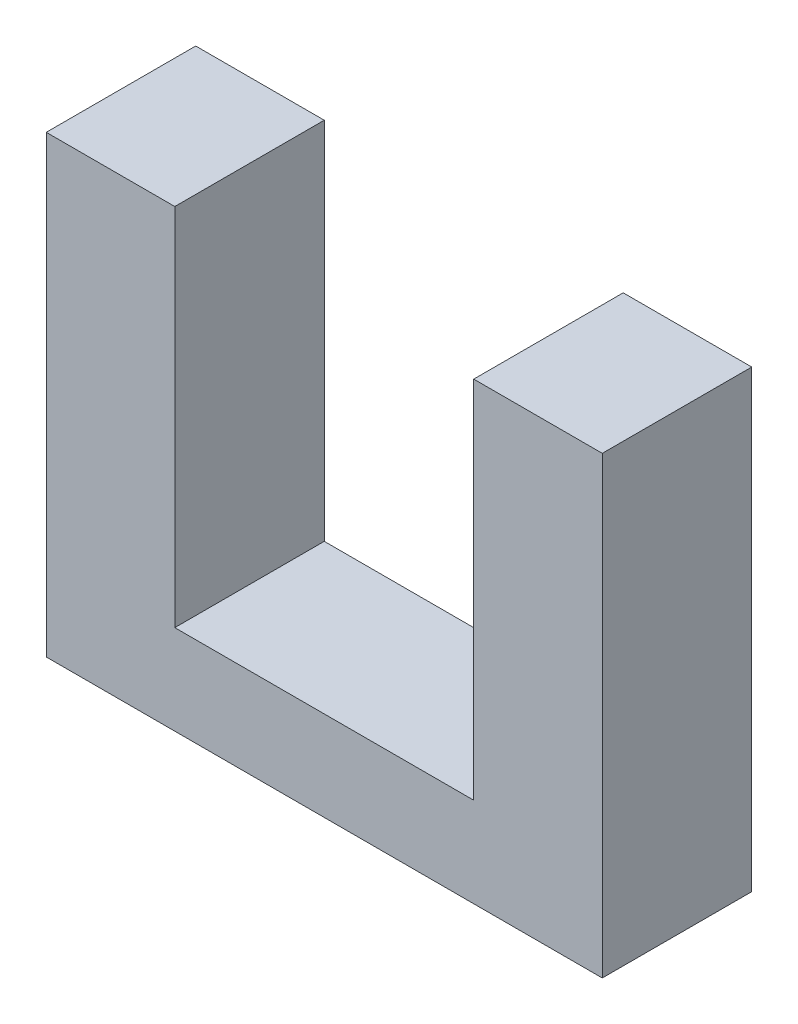
ISO-10303-21;
HEADER;
FILE_DESCRIPTION(('STEP AP214'),'2;1');
FILE_NAME('part.step','',(''),(''),'','','');
FILE_SCHEMA(('AUTOMOTIVE_DESIGN { 1 0 10303 214 1 1 1 1 }'));
ENDSEC;
DATA;
#1=APPLICATION_CONTEXT('core data for automotive mechanical design processes');
#2=APPLICATION_PROTOCOL_DEFINITION('international standard','automotive_design',2000,#1);
#3=PRODUCT_CONTEXT('',#1,'mechanical');
#4=PRODUCT('Part','Part','',(#3));
#5=PRODUCT_RELATED_PRODUCT_CATEGORY('part','',(#4));
#6=PRODUCT_DEFINITION_FORMATION('','',#4);
#7=PRODUCT_DEFINITION_CONTEXT('part definition',#1,'design');
#8=PRODUCT_DEFINITION('design','',#6,#7);
#9=PRODUCT_DEFINITION_SHAPE('','',#8);
#10=(LENGTH_UNIT() NAMED_UNIT(*) SI_UNIT(.MILLI.,.METRE.));
#11=(NAMED_UNIT(*) PLANE_ANGLE_UNIT() SI_UNIT($,.RADIAN.));
#12=(NAMED_UNIT(*) SI_UNIT($,.STERADIAN.) SOLID_ANGLE_UNIT());
#13=UNCERTAINTY_MEASURE_WITH_UNIT(LENGTH_MEASURE(1.E-05),#10,'distance_accuracy_value','');
#14=(GEOMETRIC_REPRESENTATION_CONTEXT(3) GLOBAL_UNCERTAINTY_ASSIGNED_CONTEXT((#13)) GLOBAL_UNIT_ASSIGNED_CONTEXT((#10,
#11,#12)) REPRESENTATION_CONTEXT('',''));
#15=CARTESIAN_POINT('',(0.,0.,0.));
#16=DIRECTION('',(0.,0.,1.));
#17=DIRECTION('',(1.,0.,0.));
#18=AXIS2_PLACEMENT_3D('',#15,#16,#17);
#19=CARTESIAN_POINT('',(-9.3,12.2,-5.));
#20=DIRECTION('',(-1.,0.,0.));
#21=DIRECTION('',(0.,-1.,0.));
#22=AXIS2_PLACEMENT_3D('',#19,#20,#21);
#23=PLANE('',#22);
#24=DIRECTION('',(0.,-1.,0.));
#25=VECTOR('',#24,1.);
#26=CARTESIAN_POINT('',(-9.3,12.2,0.));
#27=LINE('',#26,#25);
#28=CARTESIAN_POINT('',(-9.3,12.2,0.));
#29=VERTEX_POINT('',#28);
#30=CARTESIAN_POINT('',(-9.3,-3.,0.));
#31=VERTEX_POINT('',#30);
#32=EDGE_CURVE('E129',#29,#31,#27,.T.);
#33=ORIENTED_EDGE('',*,*,#32,.F.);
#34=DIRECTION('',(0.,0.,1.));
#35=VECTOR('',#34,1.);
#36=CARTESIAN_POINT('',(-9.3,12.2,-5.));
#37=LINE('',#36,#35);
#38=CARTESIAN_POINT('',(-9.3,12.2,-5.));
#39=VERTEX_POINT('',#38);
#40=EDGE_CURVE('E11',#39,#29,#37,.T.);
#41=ORIENTED_EDGE('',*,*,#40,.F.);
#42=DIRECTION('',(0.,-1.,0.));
#43=VECTOR('',#42,1.);
#44=CARTESIAN_POINT('',(-9.3,12.2,-5.));
#45=LINE('',#44,#43);
#46=CARTESIAN_POINT('',(-9.3,-3.,-5.));
#47=VERTEX_POINT('',#46);
#48=EDGE_CURVE('E149',#39,#47,#45,.T.);
#49=ORIENTED_EDGE('',*,*,#48,.T.);
#50=DIRECTION('',(0.,0.,1.));
#51=VECTOR('',#50,1.);
#52=CARTESIAN_POINT('',(-9.3,-3.,-5.));
#53=LINE('',#52,#51);
#54=EDGE_CURVE('E35',#47,#31,#53,.T.);
#55=ORIENTED_EDGE('',*,*,#54,.T.);
#56=EDGE_LOOP('',(#33,#41,#49,#55));
#57=FACE_BOUND('',#56,.T.);
#58=ADVANCED_FACE('F32',(#57),#23,.T.);
#59=CARTESIAN_POINT('',(-5.,12.2,-5.));
#60=DIRECTION('',(0.,1.,0.));
#61=DIRECTION('',(0.,0.,1.));
#62=AXIS2_PLACEMENT_3D('',#59,#60,#61);
#63=PLANE('',#62);
#64=DIRECTION('',(-1.,0.,0.));
#65=VECTOR('',#64,1.);
#66=CARTESIAN_POINT('',(-5.,12.2,0.));
#67=LINE('',#66,#65);
#68=CARTESIAN_POINT('',(-5.,12.2,0.));
#69=VERTEX_POINT('',#68);
#70=EDGE_CURVE('E147',#69,#29,#67,.T.);
#71=ORIENTED_EDGE('',*,*,#70,.F.);
#72=DIRECTION('',(0.,0.,1.));
#73=VECTOR('',#72,1.);
#74=CARTESIAN_POINT('',(-5.,12.2,-5.));
#75=LINE('',#74,#73);
#76=CARTESIAN_POINT('',(-5.,12.2,-5.));
#77=VERTEX_POINT('',#76);
#78=EDGE_CURVE('E41',#77,#69,#75,.T.);
#79=ORIENTED_EDGE('',*,*,#78,.F.);
#80=DIRECTION('',(-1.,0.,0.));
#81=VECTOR('',#80,1.);
#82=CARTESIAN_POINT('',(-5.,12.2,-5.));
#83=LINE('',#82,#81);
#84=EDGE_CURVE('E119',#77,#39,#83,.T.);
#85=ORIENTED_EDGE('',*,*,#84,.T.);
#86=ORIENTED_EDGE('',*,*,#40,.T.);
#87=EDGE_LOOP('',(#71,#79,#85,#86));
#88=FACE_BOUND('',#87,.T.);
#89=ADVANCED_FACE('F161',(#88),#63,.T.);
#90=CARTESIAN_POINT('',(-5.,0.,-5.));
#91=DIRECTION('',(1.,0.,0.));
#92=DIRECTION('',(0.,0.,-1.));
#93=AXIS2_PLACEMENT_3D('',#90,#91,#92);
#94=PLANE('',#93);
#95=DIRECTION('',(0.,1.,0.));
#96=VECTOR('',#95,1.);
#97=CARTESIAN_POINT('',(-5.,0.,0.));
#98=LINE('',#97,#96);
#99=CARTESIAN_POINT('',(-5.,0.,0.));
#100=VERTEX_POINT('',#99);
#101=EDGE_CURVE('E106',#100,#69,#98,.T.);
#102=ORIENTED_EDGE('',*,*,#101,.F.);
#103=DIRECTION('',(0.,0.,1.));
#104=VECTOR('',#103,1.);
#105=CARTESIAN_POINT('',(-5.,0.,-5.));
#106=LINE('',#105,#104);
#107=CARTESIAN_POINT('',(-5.,0.,-5.));
#108=VERTEX_POINT('',#107);
#109=EDGE_CURVE('E101',#108,#100,#106,.T.);
#110=ORIENTED_EDGE('',*,*,#109,.F.);
#111=DIRECTION('',(0.,1.,0.));
#112=VECTOR('',#111,1.);
#113=CARTESIAN_POINT('',(-5.,0.,-5.));
#114=LINE('',#113,#112);
#115=EDGE_CURVE('E104',#108,#77,#114,.T.);
#116=ORIENTED_EDGE('',*,*,#115,.T.);
#117=ORIENTED_EDGE('',*,*,#78,.T.);
#118=EDGE_LOOP('',(#102,#110,#116,#117));
#119=FACE_BOUND('',#118,.T.);
#120=ADVANCED_FACE('F103',(#119),#94,.T.);
#121=CARTESIAN_POINT('',(-5.,0.,-5.));
#122=DIRECTION('',(0.,1.,0.));
#123=DIRECTION('',(0.,0.,1.));
#124=AXIS2_PLACEMENT_3D('',#121,#122,#123);
#125=PLANE('',#124);
#126=DIRECTION('',(-1.,0.,0.));
#127=VECTOR('',#126,1.);
#128=CARTESIAN_POINT('',(-5.,0.,0.));
#129=LINE('',#128,#127);
#130=CARTESIAN_POINT('',(5.,0.,0.));
#131=VERTEX_POINT('',#130);
#132=EDGE_CURVE('E144',#131,#100,#129,.T.);
#133=ORIENTED_EDGE('',*,*,#132,.F.);
#134=DIRECTION('',(0.,0.,1.));
#135=VECTOR('',#134,1.);
#136=CARTESIAN_POINT('',(5.,0.,-5.));
#137=LINE('',#136,#135);
#138=CARTESIAN_POINT('',(5.,0.,-5.));
#139=VERTEX_POINT('',#138);
#140=EDGE_CURVE('E111',#139,#131,#137,.T.);
#141=ORIENTED_EDGE('',*,*,#140,.F.);
#142=DIRECTION('',(-1.,0.,0.));
#143=VECTOR('',#142,1.);
#144=CARTESIAN_POINT('',(-5.,0.,-5.));
#145=LINE('',#144,#143);
#146=EDGE_CURVE('E117',#139,#108,#145,.T.);
#147=ORIENTED_EDGE('',*,*,#146,.T.);
#148=ORIENTED_EDGE('',*,*,#109,.T.);
#149=EDGE_LOOP('',(#133,#141,#147,#148));
#150=FACE_BOUND('',#149,.T.);
#151=ADVANCED_FACE('F121',(#150),#125,.T.);
#152=CARTESIAN_POINT('',(5.,0.,-5.));
#153=DIRECTION('',(-1.,0.,0.));
#154=DIRECTION('',(0.,0.,1.));
#155=AXIS2_PLACEMENT_3D('',#152,#153,#154);
#156=PLANE('',#155);
#157=DIRECTION('',(0.,-1.,0.));
#158=VECTOR('',#157,1.);
#159=CARTESIAN_POINT('',(5.,0.,0.));
#160=LINE('',#159,#158);
#161=CARTESIAN_POINT('',(5.,12.2,0.));
#162=VERTEX_POINT('',#161);
#163=EDGE_CURVE('E141',#162,#131,#160,.T.);
#164=ORIENTED_EDGE('',*,*,#163,.F.);
#165=DIRECTION('',(0.,0.,1.));
#166=VECTOR('',#165,1.);
#167=CARTESIAN_POINT('',(5.,12.2,-5.));
#168=LINE('',#167,#166);
#169=CARTESIAN_POINT('',(5.,12.2,-5.));
#170=VERTEX_POINT('',#169);
#171=EDGE_CURVE('E153',#170,#162,#168,.T.);
#172=ORIENTED_EDGE('',*,*,#171,.F.);
#173=DIRECTION('',(0.,-1.,0.));
#174=VECTOR('',#173,1.);
#175=CARTESIAN_POINT('',(5.,0.,-5.));
#176=LINE('',#175,#174);
#177=EDGE_CURVE('E122',#170,#139,#176,.T.);
#178=ORIENTED_EDGE('',*,*,#177,.T.);
#179=ORIENTED_EDGE('',*,*,#140,.T.);
#180=EDGE_LOOP('',(#164,#172,#178,#179));
#181=FACE_BOUND('',#180,.T.);
#182=ADVANCED_FACE('F174',(#181),#156,.T.);
#183=CARTESIAN_POINT('',(5.,12.2,-5.));
#184=DIRECTION('',(0.,1.,0.));
#185=DIRECTION('',(0.,0.,1.));
#186=AXIS2_PLACEMENT_3D('',#183,#184,#185);
#187=PLANE('',#186);
#188=DIRECTION('',(-1.,0.,0.));
#189=VECTOR('',#188,1.);
#190=CARTESIAN_POINT('',(5.,12.2,0.));
#191=LINE('',#190,#189);
#192=CARTESIAN_POINT('',(9.3,12.2,0.));
#193=VERTEX_POINT('',#192);
#194=EDGE_CURVE('E138',#193,#162,#191,.T.);
#195=ORIENTED_EDGE('',*,*,#194,.F.);
#196=DIRECTION('',(0.,0.,1.));
#197=VECTOR('',#196,1.);
#198=CARTESIAN_POINT('',(9.3,12.2,-5.));
#199=LINE('',#198,#197);
#200=CARTESIAN_POINT('',(9.3,12.2,-5.));
#201=VERTEX_POINT('',#200);
#202=EDGE_CURVE('E155',#201,#193,#199,.T.);
#203=ORIENTED_EDGE('',*,*,#202,.F.);
#204=DIRECTION('',(-1.,0.,0.));
#205=VECTOR('',#204,1.);
#206=CARTESIAN_POINT('',(5.,12.2,-5.));
#207=LINE('',#206,#205);
#208=EDGE_CURVE('E124',#201,#170,#207,.T.);
#209=ORIENTED_EDGE('',*,*,#208,.T.);
#210=ORIENTED_EDGE('',*,*,#171,.T.);
#211=EDGE_LOOP('',(#195,#203,#209,#210));
#212=FACE_BOUND('',#211,.T.);
#213=ADVANCED_FACE('F177',(#212),#187,.T.);
#214=CARTESIAN_POINT('',(9.3,12.2,-5.));
#215=DIRECTION('',(1.,0.,0.));
#216=DIRECTION('',(0.,1.,0.));
#217=AXIS2_PLACEMENT_3D('',#214,#215,#216);
#218=PLANE('',#217);
#219=DIRECTION('',(0.,1.,0.));
#220=VECTOR('',#219,1.);
#221=CARTESIAN_POINT('',(9.3,12.2,0.));
#222=LINE('',#221,#220);
#223=CARTESIAN_POINT('',(9.3,-3.,0.));
#224=VERTEX_POINT('',#223);
#225=EDGE_CURVE('E135',#224,#193,#222,.T.);
#226=ORIENTED_EDGE('',*,*,#225,.F.);
#227=DIRECTION('',(0.,0.,1.));
#228=VECTOR('',#227,1.);
#229=CARTESIAN_POINT('',(9.3,-3.,-5.));
#230=LINE('',#229,#228);
#231=CARTESIAN_POINT('',(9.3,-3.,-5.));
#232=VERTEX_POINT('',#231);
#233=EDGE_CURVE('E156',#232,#224,#230,.T.);
#234=ORIENTED_EDGE('',*,*,#233,.F.);
#235=DIRECTION('',(0.,1.,0.));
#236=VECTOR('',#235,1.);
#237=CARTESIAN_POINT('',(9.3,12.2,-5.));
#238=LINE('',#237,#236);
#239=EDGE_CURVE('E252',#232,#201,#238,.T.);
#240=ORIENTED_EDGE('',*,*,#239,.T.);
#241=ORIENTED_EDGE('',*,*,#202,.T.);
#242=EDGE_LOOP('',(#226,#234,#240,#241));
#243=FACE_BOUND('',#242,.T.);
#244=ADVANCED_FACE('F181',(#243),#218,.T.);
#245=CARTESIAN_POINT('',(9.3,-3.,-5.));
#246=DIRECTION('',(0.,-1.,0.));
#247=DIRECTION('',(0.,0.,-1.));
#248=AXIS2_PLACEMENT_3D('',#245,#246,#247);
#249=PLANE('',#248);
#250=DIRECTION('',(1.,0.,0.));
#251=VECTOR('',#250,1.);
#252=CARTESIAN_POINT('',(9.3,-3.,0.));
#253=LINE('',#252,#251);
#254=EDGE_CURVE('E132',#31,#224,#253,.T.);
#255=ORIENTED_EDGE('',*,*,#254,.F.);
#256=ORIENTED_EDGE('',*,*,#54,.F.);
#257=DIRECTION('',(1.,0.,0.));
#258=VECTOR('',#257,1.);
#259=CARTESIAN_POINT('',(9.3,-3.,-5.));
#260=LINE('',#259,#258);
#261=EDGE_CURVE('E253',#47,#232,#260,.T.);
#262=ORIENTED_EDGE('',*,*,#261,.T.);
#263=ORIENTED_EDGE('',*,*,#233,.T.);
#264=EDGE_LOOP('',(#255,#256,#262,#263));
#265=FACE_BOUND('',#264,.T.);
#266=ADVANCED_FACE('F158',(#265),#249,.T.);
#267=CARTESIAN_POINT('',(0.,0.,-5.));
#268=DIRECTION('',(0.,0.,-1.));
#269=DIRECTION('',(-1.,0.,0.));
#270=AXIS2_PLACEMENT_3D('',#267,#268,#269);
#271=PLANE('',#270);
#272=ORIENTED_EDGE('',*,*,#48,.F.);
#273=ORIENTED_EDGE('',*,*,#84,.F.);
#274=ORIENTED_EDGE('',*,*,#115,.F.);
#275=ORIENTED_EDGE('',*,*,#146,.F.);
#276=ORIENTED_EDGE('',*,*,#177,.F.);
#277=ORIENTED_EDGE('',*,*,#208,.F.);
#278=ORIENTED_EDGE('',*,*,#239,.F.);
#279=ORIENTED_EDGE('',*,*,#261,.F.);
#280=EDGE_LOOP('',(#272,#273,#274,#275,#276,#277,#278,#279));
#281=FACE_BOUND('',#280,.T.);
#282=ADVANCED_FACE('F115',(#281),#271,.T.);
#283=CARTESIAN_POINT('',(0.,0.,0.));
#284=DIRECTION('',(0.,0.,-1.));
#285=DIRECTION('',(-1.,0.,0.));
#286=AXIS2_PLACEMENT_3D('',#283,#284,#285);
#287=PLANE('',#286);
#288=ORIENTED_EDGE('',*,*,#32,.T.);
#289=ORIENTED_EDGE('',*,*,#254,.T.);
#290=ORIENTED_EDGE('',*,*,#225,.T.);
#291=ORIENTED_EDGE('',*,*,#194,.T.);
#292=ORIENTED_EDGE('',*,*,#163,.T.);
#293=ORIENTED_EDGE('',*,*,#132,.T.);
#294=ORIENTED_EDGE('',*,*,#101,.T.);
#295=ORIENTED_EDGE('',*,*,#70,.T.);
#296=EDGE_LOOP('',(#288,#289,#290,#291,#292,#293,#294,#295));
#297=FACE_BOUND('',#296,.T.);
#298=ADVANCED_FACE('F160',(#297),#287,.F.);
#299=CLOSED_SHELL('',(#58,#89,#120,#151,#182,#213,#244,#266,#282,#298));
#300=MANIFOLD_SOLID_BREP('B2',#299);
#301=ADVANCED_BREP_SHAPE_REPRESENTATION('',(#18,#300),#14);
#302=SHAPE_DEFINITION_REPRESENTATION(#9,#301);
ENDSEC;
END-ISO-10303-21;
